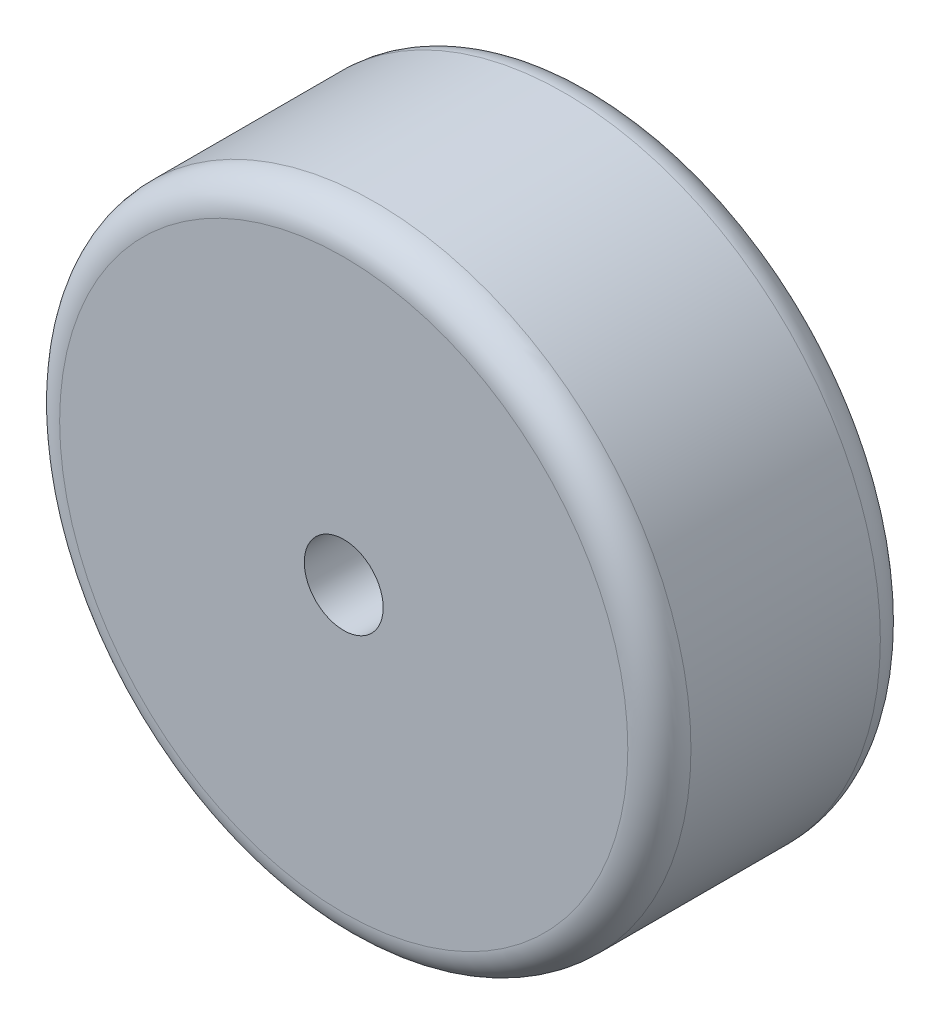
ISO-10303-21;
HEADER;
FILE_DESCRIPTION(('STEP AP214'),'2;1');
FILE_NAME('part.step','',(''),(''),'','','');
FILE_SCHEMA(('AUTOMOTIVE_DESIGN { 1 0 10303 214 1 1 1 1 }'));
ENDSEC;
DATA;
#1=APPLICATION_CONTEXT('core data for automotive mechanical design processes');
#2=APPLICATION_PROTOCOL_DEFINITION('international standard','automotive_design',2000,#1);
#3=PRODUCT_CONTEXT('',#1,'mechanical');
#4=PRODUCT('Part','Part','',(#3));
#5=PRODUCT_RELATED_PRODUCT_CATEGORY('part','',(#4));
#6=PRODUCT_DEFINITION_FORMATION('','',#4);
#7=PRODUCT_DEFINITION_CONTEXT('part definition',#1,'design');
#8=PRODUCT_DEFINITION('design','',#6,#7);
#9=PRODUCT_DEFINITION_SHAPE('','',#8);
#10=(LENGTH_UNIT() NAMED_UNIT(*) SI_UNIT(.MILLI.,.METRE.));
#11=(NAMED_UNIT(*) PLANE_ANGLE_UNIT() SI_UNIT($,.RADIAN.));
#12=(NAMED_UNIT(*) SI_UNIT($,.STERADIAN.) SOLID_ANGLE_UNIT());
#13=UNCERTAINTY_MEASURE_WITH_UNIT(LENGTH_MEASURE(1.E-05),#10,'distance_accuracy_value','');
#14=(GEOMETRIC_REPRESENTATION_CONTEXT(3) GLOBAL_UNCERTAINTY_ASSIGNED_CONTEXT((#13)) GLOBAL_UNIT_ASSIGNED_CONTEXT((#10,
#11,#12)) REPRESENTATION_CONTEXT('',''));
#15=CARTESIAN_POINT('',(0.,0.,0.));
#16=DIRECTION('',(0.,0.,1.));
#17=DIRECTION('',(1.,0.,0.));
#18=AXIS2_PLACEMENT_3D('',#15,#16,#17);
#19=CARTESIAN_POINT('',(0.,0.,20.32));
#20=DIRECTION('',(0.,0.,1.));
#21=DIRECTION('',(1.,0.,0.));
#22=AXIS2_PLACEMENT_3D('',#19,#20,#21);
#23=PLANE('',#22);
#24=CARTESIAN_POINT('',(0.,0.,20.32));
#25=DIRECTION('',(0.,0.,1.));
#26=DIRECTION('',(1.,0.,0.));
#27=AXIS2_PLACEMENT_3D('',#24,#25,#26);
#28=CIRCLE('',#27,22.86);
#29=CARTESIAN_POINT('',(22.86,0.,20.32));
#30=VERTEX_POINT('',#29);
#31=EDGE_CURVE('E10',#30,#30,#28,.T.);
#32=ORIENTED_EDGE('',*,*,#31,.T.);
#33=EDGE_LOOP('',(#32));
#34=FACE_BOUND('',#33,.T.);
#35=CARTESIAN_POINT('',(0.,0.,20.32));
#36=DIRECTION('',(0.,0.,1.));
#37=DIRECTION('',(1.,0.,0.));
#38=AXIS2_PLACEMENT_3D('',#35,#36,#37);
#39=CIRCLE('',#38,3.175);
#40=CARTESIAN_POINT('',(3.175,0.,20.32));
#41=VERTEX_POINT('',#40);
#42=EDGE_CURVE('E51',#41,#41,#39,.T.);
#43=ORIENTED_EDGE('',*,*,#42,.F.);
#44=EDGE_LOOP('',(#43));
#45=FACE_BOUND('',#44,.T.);
#46=ADVANCED_FACE('F31',(#34,#45),#23,.T.);
#47=CARTESIAN_POINT('',(0.,0.,0.));
#48=DIRECTION('',(0.,0.,1.));
#49=DIRECTION('',(1.,0.,0.));
#50=AXIS2_PLACEMENT_3D('',#47,#48,#49);
#51=PLANE('',#50);
#52=CARTESIAN_POINT('',(0.,0.,0.));
#53=DIRECTION('',(0.,0.,1.));
#54=DIRECTION('',(1.,0.,0.));
#55=AXIS2_PLACEMENT_3D('',#52,#53,#54);
#56=CIRCLE('',#55,22.86);
#57=CARTESIAN_POINT('',(22.86,0.,0.));
#58=VERTEX_POINT('',#57);
#59=EDGE_CURVE('E38',#58,#58,#56,.F.);
#60=ORIENTED_EDGE('',*,*,#59,.T.);
#61=EDGE_LOOP('',(#60));
#62=FACE_BOUND('',#61,.T.);
#63=CARTESIAN_POINT('',(0.,0.,0.));
#64=DIRECTION('',(0.,0.,1.));
#65=DIRECTION('',(1.,0.,0.));
#66=AXIS2_PLACEMENT_3D('',#63,#64,#65);
#67=CIRCLE('',#66,3.175);
#68=CARTESIAN_POINT('',(3.175,0.,0.));
#69=VERTEX_POINT('',#68);
#70=EDGE_CURVE('E52',#69,#69,#67,.T.);
#71=ORIENTED_EDGE('',*,*,#70,.T.);
#72=EDGE_LOOP('',(#71));
#73=FACE_BOUND('',#72,.T.);
#74=ADVANCED_FACE('F62',(#62,#73),#51,.F.);
#75=CARTESIAN_POINT('',(0.,0.,20.32));
#76=DIRECTION('',(0.,0.,-1.));
#77=DIRECTION('',(-1.,0.,0.));
#78=AXIS2_PLACEMENT_3D('',#75,#76,#77);
#79=CYLINDRICAL_SURFACE('',#78,25.4);
#80=CARTESIAN_POINT('',(0.,0.,2.54));
#81=DIRECTION('',(0.,0.,1.));
#82=DIRECTION('',(1.,0.,0.));
#83=AXIS2_PLACEMENT_3D('',#80,#81,#82);
#84=CIRCLE('',#83,25.4);
#85=CARTESIAN_POINT('',(25.4,0.,2.54));
#86=VERTEX_POINT('',#85);
#87=EDGE_CURVE('E42',#86,#86,#84,.T.);
#88=ORIENTED_EDGE('',*,*,#87,.T.);
#89=EDGE_LOOP('',(#88));
#90=FACE_BOUND('',#89,.T.);
#91=CARTESIAN_POINT('',(0.,0.,17.78));
#92=DIRECTION('',(0.,0.,1.));
#93=DIRECTION('',(1.,0.,0.));
#94=AXIS2_PLACEMENT_3D('',#91,#92,#93);
#95=CIRCLE('',#94,25.4);
#96=CARTESIAN_POINT('',(25.4,0.,17.78));
#97=VERTEX_POINT('',#96);
#98=EDGE_CURVE('E46',#97,#97,#95,.F.);
#99=ORIENTED_EDGE('',*,*,#98,.T.);
#100=EDGE_LOOP('',(#99));
#101=FACE_BOUND('',#100,.T.);
#102=ADVANCED_FACE('F67',(#90,#101),#79,.T.);
#103=CARTESIAN_POINT('',(0.,0.,20.32));
#104=DIRECTION('',(0.,0.,-1.));
#105=DIRECTION('',(-1.,0.,0.));
#106=AXIS2_PLACEMENT_3D('',#103,#104,#105);
#107=CYLINDRICAL_SURFACE('',#106,3.175);
#108=ORIENTED_EDGE('',*,*,#42,.T.);
#109=EDGE_LOOP('',(#108));
#110=FACE_BOUND('',#109,.T.);
#111=ORIENTED_EDGE('',*,*,#70,.F.);
#112=EDGE_LOOP('',(#111));
#113=FACE_BOUND('',#112,.T.);
#114=ADVANCED_FACE('F58',(#110,#113),#107,.F.);
#115=CARTESIAN_POINT('',(0.,0.,2.54));
#116=DIRECTION('',(0.,0.,1.));
#117=DIRECTION('',(1.,0.,0.));
#118=AXIS2_PLACEMENT_3D('',#115,#116,#117);
#119=TOROIDAL_SURFACE('',#118,22.86,2.54);
#120=ORIENTED_EDGE('',*,*,#59,.F.);
#121=EDGE_LOOP('',(#120));
#122=FACE_BOUND('',#121,.T.);
#123=ORIENTED_EDGE('',*,*,#87,.F.);
#124=EDGE_LOOP('',(#123));
#125=FACE_BOUND('',#124,.T.);
#126=ADVANCED_FACE('F73',(#122,#125),#119,.T.);
#127=CARTESIAN_POINT('',(0.,0.,17.78));
#128=DIRECTION('',(0.,0.,1.));
#129=DIRECTION('',(1.,0.,0.));
#130=AXIS2_PLACEMENT_3D('',#127,#128,#129);
#131=TOROIDAL_SURFACE('',#130,22.86,2.54);
#132=ORIENTED_EDGE('',*,*,#98,.F.);
#133=EDGE_LOOP('',(#132));
#134=FACE_BOUND('',#133,.T.);
#135=ORIENTED_EDGE('',*,*,#31,.F.);
#136=EDGE_LOOP('',(#135));
#137=FACE_BOUND('',#136,.T.);
#138=ADVANCED_FACE('F33',(#134,#137),#131,.T.);
#139=CLOSED_SHELL('',(#46,#74,#102,#114,#126,#138));
#140=MANIFOLD_SOLID_BREP('B2',#139);
#141=ADVANCED_BREP_SHAPE_REPRESENTATION('',(#18,#140),#14);
#142=SHAPE_DEFINITION_REPRESENTATION(#9,#141);
ENDSEC;
END-ISO-10303-21;
